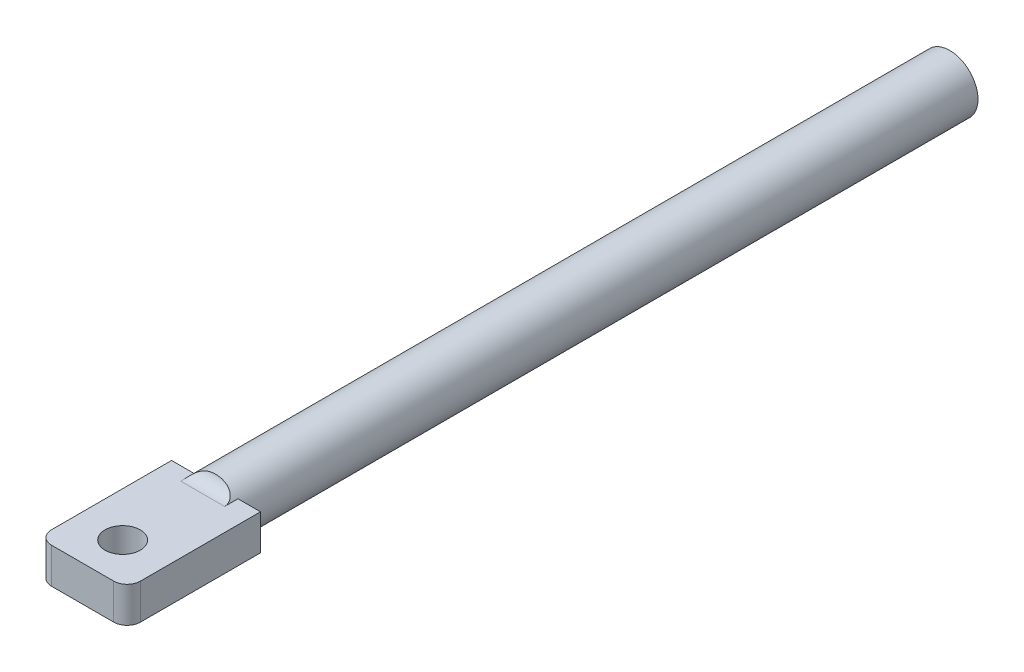
ISO-10303-21;
HEADER;
FILE_DESCRIPTION(('STEP AP214'),'2;1');
FILE_NAME('part.step','',(''),(''),'','','');
FILE_SCHEMA(('AUTOMOTIVE_DESIGN { 1 0 10303 214 1 1 1 1 }'));
ENDSEC;
DATA;
#1=APPLICATION_CONTEXT('core data for automotive mechanical design processes');
#2=APPLICATION_PROTOCOL_DEFINITION('international standard','automotive_design',2000,#1);
#3=PRODUCT_CONTEXT('',#1,'mechanical');
#4=PRODUCT('Part','Part','',(#3));
#5=PRODUCT_RELATED_PRODUCT_CATEGORY('part','',(#4));
#6=PRODUCT_DEFINITION_FORMATION('','',#4);
#7=PRODUCT_DEFINITION_CONTEXT('part definition',#1,'design');
#8=PRODUCT_DEFINITION('design','',#6,#7);
#9=PRODUCT_DEFINITION_SHAPE('','',#8);
#10=(LENGTH_UNIT() NAMED_UNIT(*) SI_UNIT(.MILLI.,.METRE.));
#11=(NAMED_UNIT(*) PLANE_ANGLE_UNIT() SI_UNIT($,.RADIAN.));
#12=(NAMED_UNIT(*) SI_UNIT($,.STERADIAN.) SOLID_ANGLE_UNIT());
#13=UNCERTAINTY_MEASURE_WITH_UNIT(LENGTH_MEASURE(1.E-05),#10,'distance_accuracy_value','');
#14=(GEOMETRIC_REPRESENTATION_CONTEXT(3) GLOBAL_UNCERTAINTY_ASSIGNED_CONTEXT((#13)) GLOBAL_UNIT_ASSIGNED_CONTEXT((#10,
#11,#12)) REPRESENTATION_CONTEXT('',''));
#15=CARTESIAN_POINT('',(0.,0.,0.));
#16=DIRECTION('',(0.,0.,1.));
#17=DIRECTION('',(1.,0.,0.));
#18=AXIS2_PLACEMENT_3D('',#15,#16,#17);
#19=CARTESIAN_POINT('',(0.,0.,165.));
#20=DIRECTION('',(0.,0.,-1.));
#21=DIRECTION('',(-1.,0.,0.));
#22=AXIS2_PLACEMENT_3D('',#19,#20,#21);
#23=CYLINDRICAL_SURFACE('',#22,6.35);
#24=DIRECTION('',(0.,0.,-1.));
#25=VECTOR('',#24,1.);
#26=CARTESIAN_POINT('',(-4.93178466683208,4.,168.));
#27=LINE('',#26,#25);
#28=CARTESIAN_POINT('',(-4.93178466683208,4.,168.));
#29=VERTEX_POINT('',#28);
#30=CARTESIAN_POINT('',(-4.93178466683208,4.,165.));
#31=VERTEX_POINT('',#30);
#32=EDGE_CURVE('E164',#29,#31,#27,.T.);
#33=ORIENTED_EDGE('',*,*,#32,.F.);
#34=CARTESIAN_POINT('',(-4.93178466683208,4.,168.));
#35=CARTESIAN_POINT('',(-4.9317840881279,3.99998719712937,167.932414770394));
#36=CARTESIAN_POINT('',(-4.92993223869871,4.00228359671481,167.86483398845));
#37=CARTESIAN_POINT('',(-4.92252396888637,4.0113988707806,167.730193904928));
#38=CARTESIAN_POINT('',(-4.9169681967614,4.01821695387769,167.663134514173));
#39=CARTESIAN_POINT('',(-4.90217232818762,4.03625257528976,167.530225884897));
#40=CARTESIAN_POINT('',(-4.89294335847857,4.04745682549166,167.464373614293));
#41=CARTESIAN_POINT('',(-4.87081011323364,4.07406508527092,167.334170870739));
#42=CARTESIAN_POINT('',(-4.85790581747322,4.08946911795878,167.269820406055));
#43=CARTESIAN_POINT('',(-4.81367795053061,4.14163124414019,167.079710952454));
#44=CARTESIAN_POINT('',(-4.77682608095043,4.18435640956361,166.956772440211));
#45=CARTESIAN_POINT('',(-4.68868739622466,4.28287776711365,166.72191276932));
#46=CARTESIAN_POINT('',(-4.63739852087332,4.33867582459206,166.609993186185));
#47=CARTESIAN_POINT('',(-4.51982218701651,4.46105775841126,166.397142726913));
#48=CARTESIAN_POINT('',(-4.45324721325244,4.5278403479238,166.296486087));
#49=CARTESIAN_POINT('',(-4.30684434397115,4.66731032397383,166.109988768887));
#50=CARTESIAN_POINT('',(-4.22700982521137,4.74000065215801,166.024155539018));
#51=CARTESIAN_POINT('',(-4.08211399819813,4.86466721670678,165.891466738458));
#52=CARTESIAN_POINT('',(-4.02007318965125,4.91612963758896,165.840747412534));
#53=CARTESIAN_POINT('',(-3.89093704856471,5.01895551587816,165.746037513237));
#54=CARTESIAN_POINT('',(-3.82384017643638,5.07031893821707,165.702049001878));
#55=CARTESIAN_POINT('',(-3.68508504860417,5.17204611995775,165.620325568451));
#56=CARTESIAN_POINT('',(-3.61342088800702,5.22240847010774,165.582598978895));
#57=CARTESIAN_POINT('',(-3.46613138232433,5.32130717740494,165.512903240867));
#58=CARTESIAN_POINT('',(-3.3905049196558,5.36984301267125,165.480935728173));
#59=CARTESIAN_POINT('',(-3.20582907256958,5.48278798491998,165.410782986704));
#60=CARTESIAN_POINT('',(-3.09517722293813,5.54606599794518,165.374983452178));
#61=CARTESIAN_POINT('',(-2.86839327158307,5.66668687428398,165.311707460723));
#62=CARTESIAN_POINT('',(-2.75225909065587,5.72402745903621,165.284234191364));
#63=CARTESIAN_POINT('',(-2.51532695807747,5.83203317045848,165.236061403674));
#64=CARTESIAN_POINT('',(-2.39452107381383,5.88268623465656,165.215374028147));
#65=CARTESIAN_POINT('',(-2.14931421308627,5.97663756079452,165.179493913843));
#66=CARTESIAN_POINT('',(-2.02491327537839,6.01993590198651,165.164301115856));
#67=CARTESIAN_POINT('',(-1.73829603630424,6.10976277997844,165.134636510341));
#68=CARTESIAN_POINT('',(-1.57516882044323,6.15385132259623,165.121535655563));
#69=CARTESIAN_POINT('',(-1.24557776837348,6.22893466011741,165.1005219062));
#70=CARTESIAN_POINT('',(-1.07911293920472,6.25992549596453,165.09261057986));
#71=CARTESIAN_POINT('',(-0.744263944424138,6.30849909854792,165.080675778061));
#72=CARTESIAN_POINT('',(-0.57588175899356,6.32609461424453,165.076648604893));
#73=CARTESIAN_POINT('',(-0.23827244850542,6.34778217716047,165.071736469216));
#74=CARTESIAN_POINT('',(-0.0690456081752225,6.35187850265747,165.070850511159));
#75=CARTESIAN_POINT('',(0.319297244661815,6.34575410017684,165.072200014997));
#76=CARTESIAN_POINT('',(0.538351453163856,6.33093594832018,165.075437187724));
#77=CARTESIAN_POINT('',(0.973555286032147,6.27874834722269,165.087866637338));
#78=CARTESIAN_POINT('',(1.18970582296507,6.24138616106049,165.097056996339));
#79=CARTESIAN_POINT('',(1.52620541371595,6.16515788018223,165.118360520863));
#80=CARTESIAN_POINT('',(1.64843628617137,6.13360041126768,165.127597022971));
#81=CARTESIAN_POINT('',(1.89052889994307,6.06335516827752,165.149726084212));
#82=CARTESIAN_POINT('',(2.01039041754732,6.02466672442958,165.16261898683));
#83=CARTESIAN_POINT('',(2.247133855668,5.94042780477434,165.192989130377));
#84=CARTESIAN_POINT('',(2.36401480901796,5.89487513389831,165.210467839101));
#85=CARTESIAN_POINT('',(2.59404191235914,5.79733054131778,165.251113130649));
#86=CARTESIAN_POINT('',(2.70718874449495,5.74533980405036,165.274278668013));
#87=CARTESIAN_POINT('',(2.90955162414545,5.64512519765324,165.322903317969));
#88=CARTESIAN_POINT('',(2.99949430740202,5.59783077598539,165.347254182354));
#89=CARTESIAN_POINT('',(3.17574099085407,5.49975765632357,165.401459585412));
#90=CARTESIAN_POINT('',(3.26204575076463,5.4489796916833,165.431312967916));
#91=CARTESIAN_POINT('',(3.43033216592592,5.34463313512841,165.497288673964));
#92=CARTESIAN_POINT('',(3.51231913593702,5.2910681433363,165.533403044037));
#93=CARTESIAN_POINT('',(3.67138867397488,5.18196112686064,165.612683331511));
#94=CARTESIAN_POINT('',(3.74847243761531,5.1264195893356,165.655847520633));
#95=CARTESIAN_POINT('',(3.93971793069379,4.98221571984481,165.776982303692));
#96=CARTESIAN_POINT('',(4.04979228694817,4.89282549296723,165.860717983332));
#97=CARTESIAN_POINT('',(4.25319211998538,4.71708865500549,166.049398609748));
#98=CARTESIAN_POINT('',(4.34652430168938,4.63074083667798,166.15433503007));
#99=CARTESIAN_POINT('',(4.47235284478825,4.50822300995553,166.327830448625));
#100=CARTESIAN_POINT('',(4.51208959365091,4.46837753383768,166.38867433247));
#101=CARTESIAN_POINT('',(4.58641482941717,4.39205232477681,166.515389819794));
#102=CARTESIAN_POINT('',(4.62100592736332,4.35557088842589,166.581258847531));
#103=CARTESIAN_POINT('',(4.68485980325411,4.28681668707044,166.717632285975));
#104=CARTESIAN_POINT('',(4.71412209110743,4.25454430925092,166.788137122227));
#105=CARTESIAN_POINT('',(4.76718334153624,4.19500285606519,166.933162957537));
#106=CARTESIAN_POINT('',(4.79098377129272,4.16773243745345,167.007682871396));
#107=CARTESIAN_POINT('',(4.84566340514959,4.1042339891094,167.205729894411));
#108=CARTESIAN_POINT('',(4.87226189428533,4.07240429787267,167.331909634593));
#109=CARTESIAN_POINT('',(4.91118159192082,4.02538758996542,167.589230056364));
#110=CARTESIAN_POINT('',(4.92353651842109,4.01016127369117,167.720358259901));
#111=CARTESIAN_POINT('',(4.92980886948691,4.00243431122943,167.876647577314));
#112=CARTESIAN_POINT('',(4.93055021220664,4.00152126150495,167.901317690927));
#113=CARTESIAN_POINT('',(4.93153762877759,4.00030499333323,167.950656193859));
#114=CARTESIAN_POINT('',(4.93178423673652,4.00000111723218,167.975324556256));
#115=CARTESIAN_POINT('',(4.93178466683229,4.,168.));
#116=B_SPLINE_CURVE_WITH_KNOTS('',3,(#34,#35,#36,#37,#38,#39,#40,#41,#42,#43,#44,#45,#46,#47,
#48,#49,#50,#51,#52,#53,#54,#55,#56,#57,#58,#59,#60,#61,#62,#63,#64,#65,#66,#67,#68,#69,#70,#71,
#72,#73,#74,#75,#76,#77,#78,#79,#80,#81,#82,#83,#84,#85,#86,#87,#88,#89,#90,#91,#92,#93,#94,#95,
#96,#97,#98,#99,#100,#101,#102,#103,#104,#105,#106,#107,#108,#109,#110,#111,#112,#113,#114,
#115),.UNSPECIFIED.,.F.,.F.,(4,2,2,2,2,2,2,2,2,2,2,2,2,2,2,2,2,2,2,2,2,2,2,2,2,2,2,2,2,2,2,2,2,
2,2,2,2,2,2,2,4),(0.,0.202683679871852,0.405331895484515,0.607370871050252,0.809410958415249,
1.21312581617362,1.61689831453385,2.02899822225229,2.44130459949859,2.72665385322954,
3.01209035065855,3.29790367482084,3.58379805235783,3.98039846912241,4.37715052646452,
4.77460871473137,5.1720626198466,5.67985068603692,6.18779213222037,6.69524954001334,
7.20254610463298,7.86002282623889,8.51728783962759,8.89678207265854,9.27631196762582,
9.65596348868878,10.0355452672089,10.3487941475078,10.6619772839825,10.9747654537712,
11.2874770575624,11.7795200141472,12.2713654748383,12.5196753806336,12.7678588542842,
13.0160651418843,13.2642046773043,13.6607628979589,14.0563804280328,14.1304695175069,
14.2044785784519),.UNSPECIFIED.);
#117=CARTESIAN_POINT('',(4.93178466683208,4.,168.));
#118=VERTEX_POINT('',#117);
#119=EDGE_CURVE('E166',#29,#118,#116,.T.);
#120=ORIENTED_EDGE('',*,*,#119,.T.);
#121=DIRECTION('',(0.,0.,-1.));
#122=VECTOR('',#121,1.);
#123=CARTESIAN_POINT('',(4.93178466683208,4.,165.));
#124=LINE('',#123,#122);
#125=CARTESIAN_POINT('',(4.93178466683208,4.,165.));
#126=VERTEX_POINT('',#125);
#127=EDGE_CURVE('E159',#126,#118,#124,.F.);
#128=ORIENTED_EDGE('',*,*,#127,.F.);
#129=CARTESIAN_POINT('',(0.,0.,165.));
#130=DIRECTION('',(0.,0.,1.));
#131=DIRECTION('',(1.,0.,0.));
#132=AXIS2_PLACEMENT_3D('',#129,#130,#131);
#133=CIRCLE('',#132,6.35);
#134=CARTESIAN_POINT('',(4.93178466683208,-4.,165.));
#135=VERTEX_POINT('',#134);
#136=EDGE_CURVE('E127',#135,#126,#133,.T.);
#137=ORIENTED_EDGE('',*,*,#136,.F.);
#138=DIRECTION('',(0.,0.,-1.));
#139=VECTOR('',#138,1.);
#140=CARTESIAN_POINT('',(4.93178466683208,-4.,168.));
#141=LINE('',#140,#139);
#142=CARTESIAN_POINT('',(4.93178466683208,-4.,168.));
#143=VERTEX_POINT('',#142);
#144=EDGE_CURVE('E196',#143,#135,#141,.T.);
#145=ORIENTED_EDGE('',*,*,#144,.F.);
#146=CARTESIAN_POINT('',(4.93178466683208,-4.,168.));
#147=CARTESIAN_POINT('',(4.9317840881279,-3.99998719712937,167.932414770394));
#148=CARTESIAN_POINT('',(4.92993223869871,-4.00228359671481,167.86483398845));
#149=CARTESIAN_POINT('',(4.92252396888637,-4.0113988707806,167.730193904928));
#150=CARTESIAN_POINT('',(4.9169681967614,-4.01821695387769,167.663134514173));
#151=CARTESIAN_POINT('',(4.90217232818762,-4.03625257528976,167.530225884897));
#152=CARTESIAN_POINT('',(4.89294335847857,-4.04745682549166,167.464373614293));
#153=CARTESIAN_POINT('',(4.87081011323364,-4.07406508527092,167.334170870739));
#154=CARTESIAN_POINT('',(4.85790581747322,-4.08946911795878,167.269820406055));
#155=CARTESIAN_POINT('',(4.81367795053061,-4.14163124414019,167.079710952454));
#156=CARTESIAN_POINT('',(4.77682608095043,-4.18435640956361,166.956772440211));
#157=CARTESIAN_POINT('',(4.68868739622466,-4.28287776711365,166.72191276932));
#158=CARTESIAN_POINT('',(4.63739852087332,-4.33867582459206,166.609993186185));
#159=CARTESIAN_POINT('',(4.51982218701651,-4.46105775841126,166.397142726913));
#160=CARTESIAN_POINT('',(4.45324721325244,-4.5278403479238,166.296486087));
#161=CARTESIAN_POINT('',(4.30684434397115,-4.66731032397383,166.109988768887));
#162=CARTESIAN_POINT('',(4.22700982521137,-4.74000065215801,166.024155539018));
#163=CARTESIAN_POINT('',(4.08211399819813,-4.86466721670678,165.891466738458));
#164=CARTESIAN_POINT('',(4.02007318965125,-4.91612963758896,165.840747412534));
#165=CARTESIAN_POINT('',(3.89093704856471,-5.01895551587816,165.746037513237));
#166=CARTESIAN_POINT('',(3.82384017643638,-5.07031893821707,165.702049001878));
#167=CARTESIAN_POINT('',(3.68508504860417,-5.17204611995775,165.620325568451));
#168=CARTESIAN_POINT('',(3.61342088800702,-5.22240847010774,165.582598978895));
#169=CARTESIAN_POINT('',(3.46613138232433,-5.32130717740494,165.512903240867));
#170=CARTESIAN_POINT('',(3.3905049196558,-5.36984301267125,165.480935728173));
#171=CARTESIAN_POINT('',(3.20582907256958,-5.48278798491998,165.410782986704));
#172=CARTESIAN_POINT('',(3.09517722293813,-5.54606599794518,165.374983452178));
#173=CARTESIAN_POINT('',(2.86839327158307,-5.66668687428398,165.311707460723));
#174=CARTESIAN_POINT('',(2.75225909065587,-5.72402745903621,165.284234191364));
#175=CARTESIAN_POINT('',(2.51532695807747,-5.83203317045848,165.236061403674));
#176=CARTESIAN_POINT('',(2.39452107381383,-5.88268623465656,165.215374028147));
#177=CARTESIAN_POINT('',(2.14931421308627,-5.97663756079452,165.179493913843));
#178=CARTESIAN_POINT('',(2.02491327537839,-6.01993590198651,165.164301115856));
#179=CARTESIAN_POINT('',(1.73829603630424,-6.10976277997844,165.134636510341));
#180=CARTESIAN_POINT('',(1.57516882044323,-6.15385132259623,165.121535655563));
#181=CARTESIAN_POINT('',(1.24557776837348,-6.22893466011741,165.1005219062));
#182=CARTESIAN_POINT('',(1.07911293920472,-6.25992549596453,165.09261057986));
#183=CARTESIAN_POINT('',(0.744263944424138,-6.30849909854792,165.080675778061));
#184=CARTESIAN_POINT('',(0.57588175899356,-6.32609461424453,165.076648604893));
#185=CARTESIAN_POINT('',(0.23827244850542,-6.34778217716047,165.071736469216));
#186=CARTESIAN_POINT('',(0.0690456081752225,-6.35187850265747,165.070850511159));
#187=CARTESIAN_POINT('',(-0.319297244661815,-6.34575410017684,165.072200014997));
#188=CARTESIAN_POINT('',(-0.538351453163856,-6.33093594832018,165.075437187724));
#189=CARTESIAN_POINT('',(-0.973555286032147,-6.27874834722269,165.087866637338));
#190=CARTESIAN_POINT('',(-1.18970582296507,-6.24138616106049,165.097056996339));
#191=CARTESIAN_POINT('',(-1.52620541371595,-6.16515788018223,165.118360520863));
#192=CARTESIAN_POINT('',(-1.64843628617137,-6.13360041126768,165.127597022971));
#193=CARTESIAN_POINT('',(-1.89052889994307,-6.06335516827752,165.149726084212));
#194=CARTESIAN_POINT('',(-2.01039041754732,-6.02466672442958,165.16261898683));
#195=CARTESIAN_POINT('',(-2.247133855668,-5.94042780477434,165.192989130377));
#196=CARTESIAN_POINT('',(-2.36401480901796,-5.89487513389831,165.210467839101));
#197=CARTESIAN_POINT('',(-2.59404191235914,-5.79733054131778,165.251113130649));
#198=CARTESIAN_POINT('',(-2.70718874449495,-5.74533980405036,165.274278668013));
#199=CARTESIAN_POINT('',(-2.90955162414545,-5.64512519765324,165.322903317969));
#200=CARTESIAN_POINT('',(-2.99949430740202,-5.59783077598539,165.347254182354));
#201=CARTESIAN_POINT('',(-3.17574099085407,-5.49975765632357,165.401459585412));
#202=CARTESIAN_POINT('',(-3.26204575076463,-5.4489796916833,165.431312967916));
#203=CARTESIAN_POINT('',(-3.43033216592592,-5.34463313512841,165.497288673964));
#204=CARTESIAN_POINT('',(-3.51231913593702,-5.2910681433363,165.533403044037));
#205=CARTESIAN_POINT('',(-3.67138867397488,-5.18196112686064,165.612683331511));
#206=CARTESIAN_POINT('',(-3.74847243761531,-5.1264195893356,165.655847520633));
#207=CARTESIAN_POINT('',(-3.93971793069379,-4.98221571984481,165.776982303692));
#208=CARTESIAN_POINT('',(-4.04979228694817,-4.89282549296723,165.860717983332));
#209=CARTESIAN_POINT('',(-4.25319211998538,-4.71708865500549,166.049398609748));
#210=CARTESIAN_POINT('',(-4.34652430168938,-4.63074083667798,166.15433503007));
#211=CARTESIAN_POINT('',(-4.47235284478825,-4.50822300995553,166.327830448625));
#212=CARTESIAN_POINT('',(-4.51208959365091,-4.46837753383768,166.38867433247));
#213=CARTESIAN_POINT('',(-4.58641482941717,-4.39205232477681,166.515389819794));
#214=CARTESIAN_POINT('',(-4.62100592736332,-4.35557088842589,166.581258847531));
#215=CARTESIAN_POINT('',(-4.68485980325411,-4.28681668707044,166.717632285975));
#216=CARTESIAN_POINT('',(-4.71412209110743,-4.25454430925092,166.788137122227));
#217=CARTESIAN_POINT('',(-4.76718334153624,-4.19500285606519,166.933162957537));
#218=CARTESIAN_POINT('',(-4.79098377129272,-4.16773243745345,167.007682871396));
#219=CARTESIAN_POINT('',(-4.84566340514959,-4.1042339891094,167.205729894411));
#220=CARTESIAN_POINT('',(-4.87226189428533,-4.07240429787267,167.331909634593));
#221=CARTESIAN_POINT('',(-4.91118159192082,-4.02538758996542,167.589230056364));
#222=CARTESIAN_POINT('',(-4.92353651842109,-4.01016127369117,167.720358259901));
#223=CARTESIAN_POINT('',(-4.92980886948691,-4.00243431122943,167.876647577314));
#224=CARTESIAN_POINT('',(-4.93055021220664,-4.00152126150495,167.901317690927));
#225=CARTESIAN_POINT('',(-4.93153762877759,-4.00030499333323,167.950656193859));
#226=CARTESIAN_POINT('',(-4.93178423673652,-4.00000111723218,167.975324556256));
#227=CARTESIAN_POINT('',(-4.93178466683229,-4.,168.));
#228=B_SPLINE_CURVE_WITH_KNOTS('',3,(#146,#147,#148,#149,#150,#151,#152,#153,#154,#155,#156,
#157,#158,#159,#160,#161,#162,#163,#164,#165,#166,#167,#168,#169,#170,#171,#172,#173,#174,#175,
#176,#177,#178,#179,#180,#181,#182,#183,#184,#185,#186,#187,#188,#189,#190,#191,#192,#193,#194,
#195,#196,#197,#198,#199,#200,#201,#202,#203,#204,#205,#206,#207,#208,#209,#210,#211,#212,#213,
#214,#215,#216,#217,#218,#219,#220,#221,#222,#223,#224,#225,#226,#227),.UNSPECIFIED.,.F.,.F.,(4,
2,2,2,2,2,2,2,2,2,2,2,2,2,2,2,2,2,2,2,2,2,2,2,2,2,2,2,2,2,2,2,2,2,2,2,2,2,2,2,4),(0.,
0.202683679871852,0.405331895484515,0.607370871050252,0.809410958415249,1.21312581617362,
1.61689831453385,2.02899822225229,2.44130459949859,2.72665385322954,3.01209035065855,
3.29790367482084,3.58379805235783,3.98039846912241,4.37715052646452,4.77460871473137,
5.1720626198466,5.67985068603692,6.18779213222037,6.69524954001334,7.20254610463298,
7.86002282623889,8.51728783962759,8.89678207265854,9.27631196762582,9.65596348868878,
10.0355452672089,10.3487941475078,10.6619772839825,10.9747654537712,11.2874770575624,
11.7795200141472,12.2713654748383,12.5196753806336,12.7678588542842,13.0160651418843,
13.2642046773043,13.6607628979589,14.0563804280328,14.1304695175069,14.2044785784519),.UNSPECIFIED.);
#229=CARTESIAN_POINT('',(-4.93178466683208,-4.,168.));
#230=VERTEX_POINT('',#229);
#231=EDGE_CURVE('E189',#143,#230,#228,.T.);
#232=ORIENTED_EDGE('',*,*,#231,.T.);
#233=DIRECTION('',(0.,0.,-1.));
#234=VECTOR('',#233,1.);
#235=CARTESIAN_POINT('',(-4.93178466683208,-4.,165.));
#236=LINE('',#235,#234);
#237=CARTESIAN_POINT('',(-4.93178466683208,-4.,165.));
#238=VERTEX_POINT('',#237);
#239=EDGE_CURVE('E173',#238,#230,#236,.F.);
#240=ORIENTED_EDGE('',*,*,#239,.F.);
#241=EDGE_CURVE('E156',#31,#238,#133,.T.);
#242=ORIENTED_EDGE('',*,*,#241,.F.);
#243=EDGE_LOOP('',(#33,#120,#128,#137,#145,#232,#240,#242));
#244=FACE_BOUND('',#243,.T.);
#245=CARTESIAN_POINT('',(0.,0.,0.));
#246=DIRECTION('',(0.,0.,1.));
#247=DIRECTION('',(1.,0.,0.));
#248=AXIS2_PLACEMENT_3D('',#245,#246,#247);
#249=CIRCLE('',#248,6.35);
#250=CARTESIAN_POINT('',(6.35,0.,0.));
#251=VERTEX_POINT('',#250);
#252=EDGE_CURVE('E118',#251,#251,#249,.T.);
#253=ORIENTED_EDGE('',*,*,#252,.T.);
#254=EDGE_LOOP('',(#253));
#255=FACE_BOUND('',#254,.T.);
#256=ADVANCED_FACE('F33',(#244,#255),#23,.T.);
#257=CARTESIAN_POINT('',(0.,0.,0.));
#258=DIRECTION('',(0.,0.,1.));
#259=DIRECTION('',(1.,0.,0.));
#260=AXIS2_PLACEMENT_3D('',#257,#258,#259);
#261=PLANE('',#260);
#262=ORIENTED_EDGE('',*,*,#252,.F.);
#263=EDGE_LOOP('',(#262));
#264=FACE_BOUND('',#263,.T.);
#265=ADVANCED_FACE('F224',(#264),#261,.F.);
#266=CARTESIAN_POINT('',(0.,0.,165.));
#267=DIRECTION('',(0.,0.,-1.));
#268=DIRECTION('',(-1.,0.,0.));
#269=AXIS2_PLACEMENT_3D('',#266,#267,#268);
#270=PLANE('',#269);
#271=DIRECTION('',(-1.,0.,0.));
#272=VECTOR('',#271,1.);
#273=CARTESIAN_POINT('',(-10.,4.,165.));
#274=LINE('',#273,#272);
#275=CARTESIAN_POINT('',(-10.,4.,165.));
#276=VERTEX_POINT('',#275);
#277=EDGE_CURVE('E129',#31,#276,#274,.T.);
#278=ORIENTED_EDGE('',*,*,#277,.F.);
#279=ORIENTED_EDGE('',*,*,#241,.T.);
#280=DIRECTION('',(1.,0.,0.));
#281=VECTOR('',#280,1.);
#282=CARTESIAN_POINT('',(-10.,-4.,165.));
#283=LINE('',#282,#281);
#284=CARTESIAN_POINT('',(-10.,-4.,165.));
#285=VERTEX_POINT('',#284);
#286=EDGE_CURVE('E147',#285,#238,#283,.T.);
#287=ORIENTED_EDGE('',*,*,#286,.F.);
#288=DIRECTION('',(0.,-1.,0.));
#289=VECTOR('',#288,1.);
#290=CARTESIAN_POINT('',(-10.,-4.,165.));
#291=LINE('',#290,#289);
#292=EDGE_CURVE('E128',#276,#285,#291,.T.);
#293=ORIENTED_EDGE('',*,*,#292,.F.);
#294=EDGE_LOOP('',(#278,#279,#287,#293));
#295=FACE_BOUND('',#294,.T.);
#296=ADVANCED_FACE('F229',(#295),#270,.T.);
#297=CARTESIAN_POINT('',(10.,-4.,195.));
#298=DIRECTION('',(-1.,0.,0.));
#299=DIRECTION('',(0.,0.,1.));
#300=AXIS2_PLACEMENT_3D('',#297,#298,#299);
#301=PLANE('',#300);
#302=DIRECTION('',(0.,0.,-1.));
#303=VECTOR('',#302,1.);
#304=CARTESIAN_POINT('',(10.,4.,195.));
#305=LINE('',#304,#303);
#306=CARTESIAN_POINT('',(10.,4.,192.));
#307=VERTEX_POINT('',#306);
#308=CARTESIAN_POINT('',(10.,4.,165.));
#309=VERTEX_POINT('',#308);
#310=EDGE_CURVE('E109',#307,#309,#305,.T.);
#311=ORIENTED_EDGE('',*,*,#310,.F.);
#312=DIRECTION('',(0.,1.,0.));
#313=VECTOR('',#312,1.);
#314=CARTESIAN_POINT('',(10.,-4.,192.));
#315=LINE('',#314,#313);
#316=CARTESIAN_POINT('',(10.,-4.,192.));
#317=VERTEX_POINT('',#316);
#318=EDGE_CURVE('E56',#307,#317,#315,.F.);
#319=ORIENTED_EDGE('',*,*,#318,.T.);
#320=DIRECTION('',(0.,0.,-1.));
#321=VECTOR('',#320,1.);
#322=CARTESIAN_POINT('',(10.,-4.,195.));
#323=LINE('',#322,#321);
#324=CARTESIAN_POINT('',(10.,-4.,165.));
#325=VERTEX_POINT('',#324);
#326=EDGE_CURVE('E132',#317,#325,#323,.T.);
#327=ORIENTED_EDGE('',*,*,#326,.T.);
#328=DIRECTION('',(0.,1.,0.));
#329=VECTOR('',#328,1.);
#330=CARTESIAN_POINT('',(10.,-4.,165.));
#331=LINE('',#330,#329);
#332=EDGE_CURVE('E125',#325,#309,#331,.T.);
#333=ORIENTED_EDGE('',*,*,#332,.T.);
#334=EDGE_LOOP('',(#311,#319,#327,#333));
#335=FACE_BOUND('',#334,.T.);
#336=ADVANCED_FACE('F131',(#335),#301,.F.);
#337=CARTESIAN_POINT('',(-10.,4.,195.));
#338=DIRECTION('',(0.,-1.,0.));
#339=DIRECTION('',(0.,0.,-1.));
#340=AXIS2_PLACEMENT_3D('',#337,#338,#339);
#341=PLANE('',#340);
#342=CARTESIAN_POINT('',(0.,4.,186.));
#343=DIRECTION('',(0.,-1.,0.));
#344=DIRECTION('',(0.,0.,-1.));
#345=AXIS2_PLACEMENT_3D('',#342,#343,#344);
#346=CIRCLE('',#345,3.96875);
#347=CARTESIAN_POINT('',(0.,4.,182.03125));
#348=VERTEX_POINT('',#347);
#349=EDGE_CURVE('E134',#348,#348,#346,.T.);
#350=ORIENTED_EDGE('',*,*,#349,.T.);
#351=EDGE_LOOP('',(#350));
#352=FACE_BOUND('',#351,.T.);
#353=DIRECTION('',(-1.,0.,0.));
#354=VECTOR('',#353,1.);
#355=CARTESIAN_POINT('',(-10.,4.,195.));
#356=LINE('',#355,#354);
#357=CARTESIAN_POINT('',(7.,4.,195.));
#358=VERTEX_POINT('',#357);
#359=CARTESIAN_POINT('',(-7.,4.,195.));
#360=VERTEX_POINT('',#359);
#361=EDGE_CURVE('E150',#358,#360,#356,.T.);
#362=ORIENTED_EDGE('',*,*,#361,.F.);
#363=CARTESIAN_POINT('',(7.,4.,192.));
#364=DIRECTION('',(0.,-1.,0.));
#365=DIRECTION('',(0.,0.,-1.));
#366=AXIS2_PLACEMENT_3D('',#363,#364,#365);
#367=CIRCLE('',#366,3.);
#368=EDGE_CURVE('E116',#358,#307,#367,.F.);
#369=ORIENTED_EDGE('',*,*,#368,.T.);
#370=ORIENTED_EDGE('',*,*,#310,.T.);
#371=EDGE_CURVE('E114',#309,#126,#274,.T.);
#372=ORIENTED_EDGE('',*,*,#371,.T.);
#373=ORIENTED_EDGE('',*,*,#127,.T.);
#374=DIRECTION('',(-1.,0.,0.));
#375=VECTOR('',#374,1.);
#376=CARTESIAN_POINT('',(-10.,4.,168.));
#377=LINE('',#376,#375);
#378=EDGE_CURVE('E161',#118,#29,#377,.T.);
#379=ORIENTED_EDGE('',*,*,#378,.T.);
#380=ORIENTED_EDGE('',*,*,#32,.T.);
#381=ORIENTED_EDGE('',*,*,#277,.T.);
#382=DIRECTION('',(0.,0.,-1.));
#383=VECTOR('',#382,1.);
#384=CARTESIAN_POINT('',(-10.,4.,195.));
#385=LINE('',#384,#383);
#386=CARTESIAN_POINT('',(-10.,4.,192.));
#387=VERTEX_POINT('',#386);
#388=EDGE_CURVE('E119',#387,#276,#385,.T.);
#389=ORIENTED_EDGE('',*,*,#388,.F.);
#390=CARTESIAN_POINT('',(-7.,4.,192.));
#391=DIRECTION('',(0.,-1.,0.));
#392=DIRECTION('',(0.,0.,-1.));
#393=AXIS2_PLACEMENT_3D('',#390,#391,#392);
#394=CIRCLE('',#393,3.);
#395=EDGE_CURVE('E202',#387,#360,#394,.F.);
#396=ORIENTED_EDGE('',*,*,#395,.T.);
#397=EDGE_LOOP('',(#362,#369,#370,#372,#373,#379,#380,#381,#389,#396));
#398=FACE_BOUND('',#397,.T.);
#399=ADVANCED_FACE('F112',(#352,#398),#341,.F.);
#400=CARTESIAN_POINT('',(-10.,-4.,195.));
#401=DIRECTION('',(1.,0.,0.));
#402=DIRECTION('',(0.,0.,-1.));
#403=AXIS2_PLACEMENT_3D('',#400,#401,#402);
#404=PLANE('',#403);
#405=DIRECTION('',(0.,0.,-1.));
#406=VECTOR('',#405,1.);
#407=CARTESIAN_POINT('',(-10.,-4.,195.));
#408=LINE('',#407,#406);
#409=CARTESIAN_POINT('',(-10.,-4.,192.));
#410=VERTEX_POINT('',#409);
#411=EDGE_CURVE('E152',#410,#285,#408,.T.);
#412=ORIENTED_EDGE('',*,*,#411,.F.);
#413=DIRECTION('',(0.,-1.,0.));
#414=VECTOR('',#413,1.);
#415=CARTESIAN_POINT('',(-10.,-4.,192.));
#416=LINE('',#415,#414);
#417=EDGE_CURVE('E11',#410,#387,#416,.F.);
#418=ORIENTED_EDGE('',*,*,#417,.T.);
#419=ORIENTED_EDGE('',*,*,#388,.T.);
#420=ORIENTED_EDGE('',*,*,#292,.T.);
#421=EDGE_LOOP('',(#412,#418,#419,#420));
#422=FACE_BOUND('',#421,.T.);
#423=ADVANCED_FACE('F250',(#422),#404,.F.);
#424=CARTESIAN_POINT('',(-10.,-4.,195.));
#425=DIRECTION('',(0.,1.,0.));
#426=DIRECTION('',(0.,0.,1.));
#427=AXIS2_PLACEMENT_3D('',#424,#425,#426);
#428=PLANE('',#427);
#429=CARTESIAN_POINT('',(0.,-4.,186.));
#430=DIRECTION('',(0.,-1.,0.));
#431=DIRECTION('',(0.,0.,-1.));
#432=AXIS2_PLACEMENT_3D('',#429,#430,#431);
#433=CIRCLE('',#432,3.96875);
#434=CARTESIAN_POINT('',(0.,-4.,182.03125));
#435=VERTEX_POINT('',#434);
#436=EDGE_CURVE('E138',#435,#435,#433,.T.);
#437=ORIENTED_EDGE('',*,*,#436,.F.);
#438=EDGE_LOOP('',(#437));
#439=FACE_BOUND('',#438,.T.);
#440=ORIENTED_EDGE('',*,*,#326,.F.);
#441=CARTESIAN_POINT('',(7.,-4.,192.));
#442=DIRECTION('',(0.,1.,0.));
#443=DIRECTION('',(0.,0.,1.));
#444=AXIS2_PLACEMENT_3D('',#441,#442,#443);
#445=CIRCLE('',#444,3.);
#446=CARTESIAN_POINT('',(7.,-4.,195.));
#447=VERTEX_POINT('',#446);
#448=EDGE_CURVE('E41',#317,#447,#445,.F.);
#449=ORIENTED_EDGE('',*,*,#448,.T.);
#450=DIRECTION('',(1.,0.,0.));
#451=VECTOR('',#450,1.);
#452=CARTESIAN_POINT('',(-10.,-4.,195.));
#453=LINE('',#452,#451);
#454=CARTESIAN_POINT('',(-7.,-4.,195.));
#455=VERTEX_POINT('',#454);
#456=EDGE_CURVE('E141',#455,#447,#453,.T.);
#457=ORIENTED_EDGE('',*,*,#456,.F.);
#458=CARTESIAN_POINT('',(-7.,-4.,192.));
#459=DIRECTION('',(0.,1.,0.));
#460=DIRECTION('',(0.,0.,1.));
#461=AXIS2_PLACEMENT_3D('',#458,#459,#460);
#462=CIRCLE('',#461,3.);
#463=EDGE_CURVE('E48',#455,#410,#462,.F.);
#464=ORIENTED_EDGE('',*,*,#463,.T.);
#465=ORIENTED_EDGE('',*,*,#411,.T.);
#466=ORIENTED_EDGE('',*,*,#286,.T.);
#467=ORIENTED_EDGE('',*,*,#239,.T.);
#468=DIRECTION('',(1.,0.,0.));
#469=VECTOR('',#468,1.);
#470=CARTESIAN_POINT('',(-10.,-4.,168.));
#471=LINE('',#470,#469);
#472=EDGE_CURVE('E242',#230,#143,#471,.T.);
#473=ORIENTED_EDGE('',*,*,#472,.T.);
#474=ORIENTED_EDGE('',*,*,#144,.T.);
#475=EDGE_CURVE('E146',#135,#325,#283,.T.);
#476=ORIENTED_EDGE('',*,*,#475,.T.);
#477=EDGE_LOOP('',(#440,#449,#457,#464,#465,#466,#467,#473,#474,#476));
#478=FACE_BOUND('',#477,.T.);
#479=ADVANCED_FACE('F208',(#439,#478),#428,.F.);
#480=CARTESIAN_POINT('',(0.,0.,195.));
#481=DIRECTION('',(0.,0.,-1.));
#482=DIRECTION('',(-1.,0.,0.));
#483=AXIS2_PLACEMENT_3D('',#480,#481,#482);
#484=PLANE('',#483);
#485=ORIENTED_EDGE('',*,*,#456,.T.);
#486=DIRECTION('',(0.,1.,0.));
#487=VECTOR('',#486,1.);
#488=CARTESIAN_POINT('',(7.,0.,195.));
#489=LINE('',#488,#487);
#490=EDGE_CURVE('E199',#447,#358,#489,.T.);
#491=ORIENTED_EDGE('',*,*,#490,.T.);
#492=ORIENTED_EDGE('',*,*,#361,.T.);
#493=DIRECTION('',(0.,-1.,0.));
#494=VECTOR('',#493,1.);
#495=CARTESIAN_POINT('',(-7.,0.,195.));
#496=LINE('',#495,#494);
#497=EDGE_CURVE('E195',#360,#455,#496,.T.);
#498=ORIENTED_EDGE('',*,*,#497,.T.);
#499=EDGE_LOOP('',(#485,#491,#492,#498));
#500=FACE_BOUND('',#499,.T.);
#501=ADVANCED_FACE('F212',(#500),#484,.F.);
#502=ORIENTED_EDGE('',*,*,#475,.F.);
#503=ORIENTED_EDGE('',*,*,#136,.T.);
#504=ORIENTED_EDGE('',*,*,#371,.F.);
#505=ORIENTED_EDGE('',*,*,#332,.F.);
#506=EDGE_LOOP('',(#502,#503,#504,#505));
#507=FACE_BOUND('',#506,.T.);
#508=ADVANCED_FACE('F124',(#507),#270,.T.);
#509=CARTESIAN_POINT('',(-10.,7.,168.));
#510=DIRECTION('',(-1.,0.,0.));
#511=DIRECTION('',(0.,0.,1.));
#512=AXIS2_PLACEMENT_3D('',#509,#510,#511);
#513=CYLINDRICAL_SURFACE('',#512,3.);
#514=ORIENTED_EDGE('',*,*,#378,.F.);
#515=ORIENTED_EDGE('',*,*,#119,.F.);
#516=EDGE_LOOP('',(#514,#515));
#517=FACE_BOUND('',#516,.T.);
#518=ADVANCED_FACE('F177',(#517),#513,.F.);
#519=CARTESIAN_POINT('',(-10.,-7.,168.));
#520=DIRECTION('',(1.,0.,0.));
#521=DIRECTION('',(0.,0.,-1.));
#522=AXIS2_PLACEMENT_3D('',#519,#520,#521);
#523=CYLINDRICAL_SURFACE('',#522,3.);
#524=ORIENTED_EDGE('',*,*,#472,.F.);
#525=ORIENTED_EDGE('',*,*,#231,.F.);
#526=EDGE_LOOP('',(#524,#525));
#527=FACE_BOUND('',#526,.T.);
#528=ADVANCED_FACE('F181',(#527),#523,.F.);
#529=CARTESIAN_POINT('',(0.,26.,186.));
#530=DIRECTION('',(0.,-1.,0.));
#531=DIRECTION('',(0.,0.,-1.));
#532=AXIS2_PLACEMENT_3D('',#529,#530,#531);
#533=CYLINDRICAL_SURFACE('',#532,3.96875);
#534=ORIENTED_EDGE('',*,*,#436,.T.);
#535=EDGE_LOOP('',(#534));
#536=FACE_BOUND('',#535,.T.);
#537=ORIENTED_EDGE('',*,*,#349,.F.);
#538=EDGE_LOOP('',(#537));
#539=FACE_BOUND('',#538,.T.);
#540=ADVANCED_FACE('F185',(#536,#539),#533,.F.);
#541=CARTESIAN_POINT('',(7.,0.,192.));
#542=DIRECTION('',(0.,1.,0.));
#543=DIRECTION('',(0.,0.,1.));
#544=AXIS2_PLACEMENT_3D('',#541,#542,#543);
#545=CYLINDRICAL_SURFACE('',#544,3.);
#546=ORIENTED_EDGE('',*,*,#448,.F.);
#547=ORIENTED_EDGE('',*,*,#318,.F.);
#548=ORIENTED_EDGE('',*,*,#368,.F.);
#549=ORIENTED_EDGE('',*,*,#490,.F.);
#550=EDGE_LOOP('',(#546,#547,#548,#549));
#551=FACE_BOUND('',#550,.T.);
#552=ADVANCED_FACE('F187',(#551),#545,.T.);
#553=CARTESIAN_POINT('',(-7.,0.,192.));
#554=DIRECTION('',(0.,-1.,0.));
#555=DIRECTION('',(0.,0.,-1.));
#556=AXIS2_PLACEMENT_3D('',#553,#554,#555);
#557=CYLINDRICAL_SURFACE('',#556,3.);
#558=ORIENTED_EDGE('',*,*,#395,.F.);
#559=ORIENTED_EDGE('',*,*,#417,.F.);
#560=ORIENTED_EDGE('',*,*,#463,.F.);
#561=ORIENTED_EDGE('',*,*,#497,.F.);
#562=EDGE_LOOP('',(#558,#559,#560,#561));
#563=FACE_BOUND('',#562,.T.);
#564=ADVANCED_FACE('F35',(#563),#557,.T.);
#565=CLOSED_SHELL('',(#256,#265,#296,#336,#399,#423,#479,#501,#508,#518,#528,#540,#552,#564));
#566=MANIFOLD_SOLID_BREP('B2',#565);
#567=ADVANCED_BREP_SHAPE_REPRESENTATION('',(#18,#566),#14);
#568=SHAPE_DEFINITION_REPRESENTATION(#9,#567);
ENDSEC;
END-ISO-10303-21;
